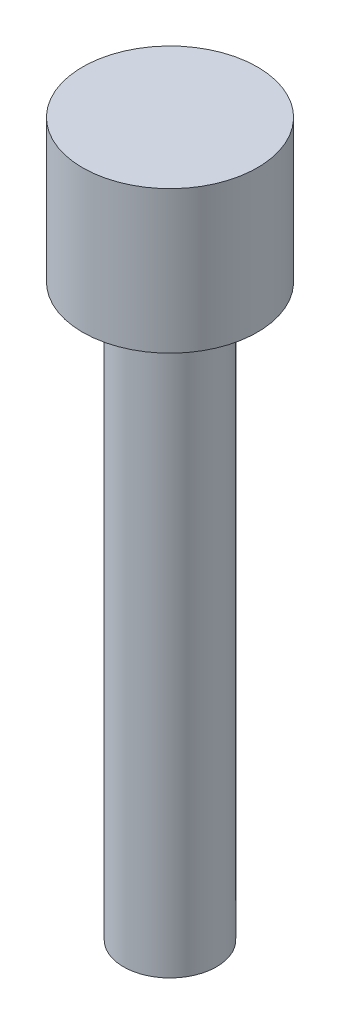
ISO-10303-21;
HEADER;
FILE_DESCRIPTION(('STEP AP214'),'2;1');
FILE_NAME('part.step','',(''),(''),'','','');
FILE_SCHEMA(('AUTOMOTIVE_DESIGN { 1 0 10303 214 1 1 1 1 }'));
ENDSEC;
DATA;
#1=APPLICATION_CONTEXT('core data for automotive mechanical design processes');
#2=APPLICATION_PROTOCOL_DEFINITION('international standard','automotive_design',2000,#1);
#3=PRODUCT_CONTEXT('',#1,'mechanical');
#4=PRODUCT('Part','Part','',(#3));
#5=PRODUCT_RELATED_PRODUCT_CATEGORY('part','',(#4));
#6=PRODUCT_DEFINITION_FORMATION('','',#4);
#7=PRODUCT_DEFINITION_CONTEXT('part definition',#1,'design');
#8=PRODUCT_DEFINITION('design','',#6,#7);
#9=PRODUCT_DEFINITION_SHAPE('','',#8);
#10=(LENGTH_UNIT() NAMED_UNIT(*) SI_UNIT(.MILLI.,.METRE.));
#11=(NAMED_UNIT(*) PLANE_ANGLE_UNIT() SI_UNIT($,.RADIAN.));
#12=(NAMED_UNIT(*) SI_UNIT($,.STERADIAN.) SOLID_ANGLE_UNIT());
#13=UNCERTAINTY_MEASURE_WITH_UNIT(LENGTH_MEASURE(1.E-05),#10,'distance_accuracy_value','');
#14=(GEOMETRIC_REPRESENTATION_CONTEXT(3) GLOBAL_UNCERTAINTY_ASSIGNED_CONTEXT((#13)) GLOBAL_UNIT_ASSIGNED_CONTEXT((#10,
#11,#12)) REPRESENTATION_CONTEXT('',''));
#15=CARTESIAN_POINT('',(0.,0.,0.));
#16=DIRECTION('',(0.,0.,1.));
#17=DIRECTION('',(1.,0.,0.));
#18=AXIS2_PLACEMENT_3D('',#15,#16,#17);
#19=CARTESIAN_POINT('',(0.,3.,0.));
#20=DIRECTION('',(0.,-1.,0.));
#21=DIRECTION('',(0.,0.,-1.));
#22=AXIS2_PLACEMENT_3D('',#19,#20,#21);
#23=CYLINDRICAL_SURFACE('',#22,1.84);
#24=CARTESIAN_POINT('',(0.,3.,0.));
#25=DIRECTION('',(0.,1.,0.));
#26=DIRECTION('',(0.,0.,1.));
#27=AXIS2_PLACEMENT_3D('',#24,#25,#26);
#28=CIRCLE('',#27,1.84);
#29=CARTESIAN_POINT('',(0.,3.,1.84));
#30=VERTEX_POINT('',#29);
#31=EDGE_CURVE('E45',#30,#30,#28,.T.);
#32=ORIENTED_EDGE('',*,*,#31,.F.);
#33=EDGE_LOOP('',(#32));
#34=FACE_BOUND('',#33,.T.);
#35=CARTESIAN_POINT('',(0.,0.,0.));
#36=DIRECTION('',(0.,1.,0.));
#37=DIRECTION('',(0.,0.,1.));
#38=AXIS2_PLACEMENT_3D('',#35,#36,#37);
#39=CIRCLE('',#38,1.84);
#40=CARTESIAN_POINT('',(0.,0.,1.84));
#41=VERTEX_POINT('',#40);
#42=EDGE_CURVE('E40',#41,#41,#39,.T.);
#43=ORIENTED_EDGE('',*,*,#42,.T.);
#44=EDGE_LOOP('',(#43));
#45=FACE_BOUND('',#44,.T.);
#46=ADVANCED_FACE('F37',(#34,#45),#23,.T.);
#47=CARTESIAN_POINT('',(0.,3.,0.));
#48=DIRECTION('',(0.,1.,0.));
#49=DIRECTION('',(0.,0.,1.));
#50=AXIS2_PLACEMENT_3D('',#47,#48,#49);
#51=PLANE('',#50);
#52=ORIENTED_EDGE('',*,*,#31,.T.);
#53=EDGE_LOOP('',(#52));
#54=FACE_BOUND('',#53,.T.);
#55=ADVANCED_FACE('F65',(#54),#51,.T.);
#56=CARTESIAN_POINT('',(0.,0.,0.));
#57=DIRECTION('',(0.,1.,0.));
#58=DIRECTION('',(0.,0.,1.));
#59=AXIS2_PLACEMENT_3D('',#56,#57,#58);
#60=PLANE('',#59);
#61=CARTESIAN_POINT('',(0.,0.,0.));
#62=DIRECTION('',(0.,-1.,0.));
#63=DIRECTION('',(0.,0.,-1.));
#64=AXIS2_PLACEMENT_3D('',#61,#62,#63);
#65=CIRCLE('',#64,0.98);
#66=CARTESIAN_POINT('',(0.,0.,-0.98));
#67=VERTEX_POINT('',#66);
#68=EDGE_CURVE('E10',#67,#67,#65,.T.);
#69=ORIENTED_EDGE('',*,*,#68,.F.);
#70=EDGE_LOOP('',(#69));
#71=FACE_BOUND('',#70,.T.);
#72=ORIENTED_EDGE('',*,*,#42,.F.);
#73=EDGE_LOOP('',(#72));
#74=FACE_BOUND('',#73,.T.);
#75=ADVANCED_FACE('F62',(#71,#74),#60,.F.);
#76=CARTESIAN_POINT('',(0.,-12.,0.));
#77=DIRECTION('',(0.,1.,0.));
#78=DIRECTION('',(0.,0.,1.));
#79=AXIS2_PLACEMENT_3D('',#76,#77,#78);
#80=CYLINDRICAL_SURFACE('',#79,0.98);
#81=CARTESIAN_POINT('',(0.,-12.,0.));
#82=DIRECTION('',(0.,-1.,0.));
#83=DIRECTION('',(0.,0.,-1.));
#84=AXIS2_PLACEMENT_3D('',#81,#82,#83);
#85=CIRCLE('',#84,0.98);
#86=CARTESIAN_POINT('',(0.,-12.,-0.98));
#87=VERTEX_POINT('',#86);
#88=EDGE_CURVE('E52',#87,#87,#85,.T.);
#89=ORIENTED_EDGE('',*,*,#88,.F.);
#90=EDGE_LOOP('',(#89));
#91=FACE_BOUND('',#90,.T.);
#92=ORIENTED_EDGE('',*,*,#68,.T.);
#93=EDGE_LOOP('',(#92));
#94=FACE_BOUND('',#93,.T.);
#95=ADVANCED_FACE('F64',(#91,#94),#80,.T.);
#96=CARTESIAN_POINT('',(0.,-12.,0.));
#97=DIRECTION('',(0.,-1.,0.));
#98=DIRECTION('',(0.,0.,-1.));
#99=AXIS2_PLACEMENT_3D('',#96,#97,#98);
#100=PLANE('',#99);
#101=ORIENTED_EDGE('',*,*,#88,.T.);
#102=EDGE_LOOP('',(#101));
#103=FACE_BOUND('',#102,.T.);
#104=ADVANCED_FACE('F71',(#103),#100,.T.);
#105=CLOSED_SHELL('',(#46,#55,#75,#95,#104));
#106=MANIFOLD_SOLID_BREP('B2',#105);
#107=ADVANCED_BREP_SHAPE_REPRESENTATION('',(#18,#106),#14);
#108=SHAPE_DEFINITION_REPRESENTATION(#9,#107);
ENDSEC;
END-ISO-10303-21;
